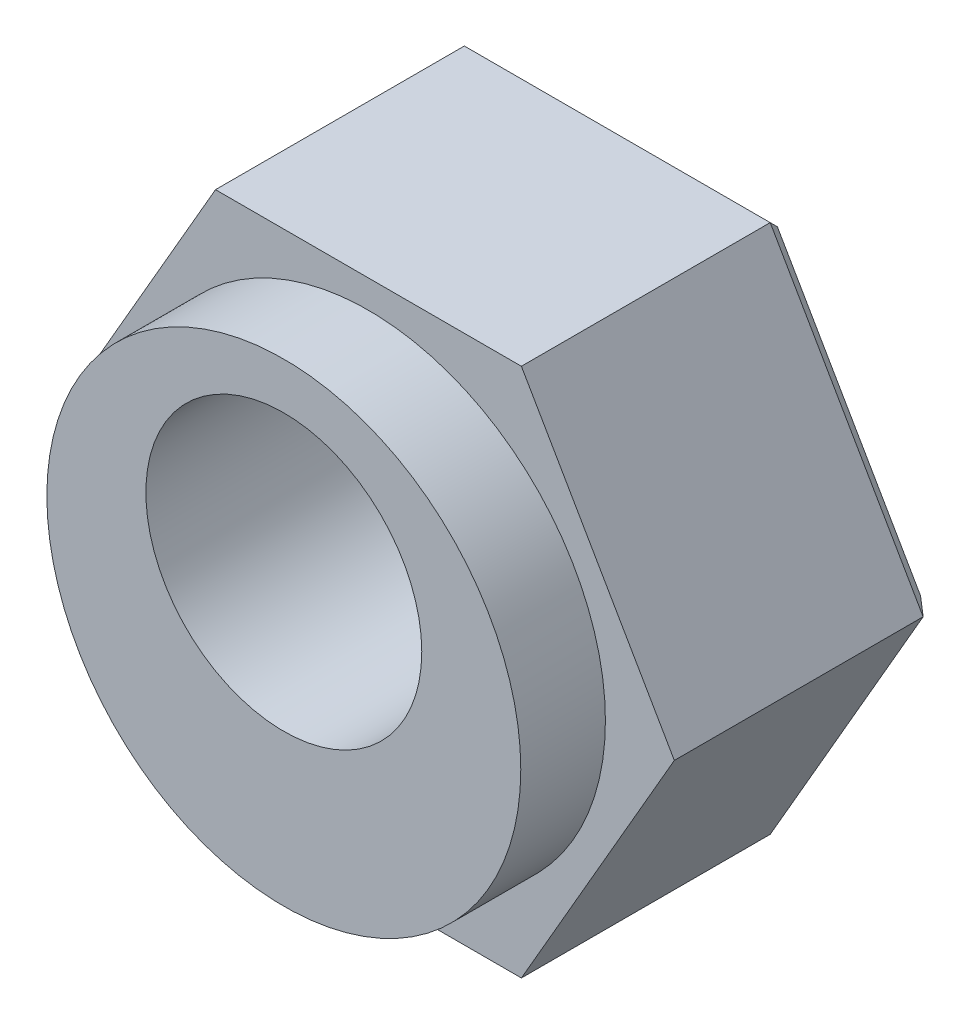
ISO-10303-21;
HEADER;
FILE_DESCRIPTION(('STEP AP214'),'2;1');
FILE_NAME('part.step','',(''),(''),'','','');
FILE_SCHEMA(('AUTOMOTIVE_DESIGN { 1 0 10303 214 1 1 1 1 }'));
ENDSEC;
DATA;
#1=APPLICATION_CONTEXT('core data for automotive mechanical design processes');
#2=APPLICATION_PROTOCOL_DEFINITION('international standard','automotive_design',2000,#1);
#3=PRODUCT_CONTEXT('',#1,'mechanical');
#4=PRODUCT('Part','Part','',(#3));
#5=PRODUCT_RELATED_PRODUCT_CATEGORY('part','',(#4));
#6=PRODUCT_DEFINITION_FORMATION('','',#4);
#7=PRODUCT_DEFINITION_CONTEXT('part definition',#1,'design');
#8=PRODUCT_DEFINITION('design','',#6,#7);
#9=PRODUCT_DEFINITION_SHAPE('','',#8);
#10=(LENGTH_UNIT() NAMED_UNIT(*) SI_UNIT(.MILLI.,.METRE.));
#11=(NAMED_UNIT(*) PLANE_ANGLE_UNIT() SI_UNIT($,.RADIAN.));
#12=(NAMED_UNIT(*) SI_UNIT($,.STERADIAN.) SOLID_ANGLE_UNIT());
#13=UNCERTAINTY_MEASURE_WITH_UNIT(LENGTH_MEASURE(1.E-05),#10,'distance_accuracy_value','');
#14=(GEOMETRIC_REPRESENTATION_CONTEXT(3) GLOBAL_UNCERTAINTY_ASSIGNED_CONTEXT((#13)) GLOBAL_UNIT_ASSIGNED_CONTEXT((#10,
#11,#12)) REPRESENTATION_CONTEXT('',''));
#15=CARTESIAN_POINT('',(0.,0.,0.));
#16=DIRECTION('',(0.,0.,1.));
#17=DIRECTION('',(1.,0.,0.));
#18=AXIS2_PLACEMENT_3D('',#15,#16,#17);
#19=CARTESIAN_POINT('',(-4.59005011011137,0.,0.));
#20=DIRECTION('',(-0.866025403784437,-0.500000000000003,0.));
#21=DIRECTION('',(0.500000000000003,-0.866025403784437,0.));
#22=AXIS2_PLACEMENT_3D('',#19,#20,#21);
#23=PLANE('',#22);
#24=DIRECTION('',(0.500000000000004,-0.866025403784436,0.));
#25=VECTOR('',#24,1.);
#26=CARTESIAN_POINT('',(-4.59005011011137,0.,3.9878));
#27=LINE('',#26,#25);
#28=CARTESIAN_POINT('',(-4.59005011011137,0.,3.9878));
#29=VERTEX_POINT('',#28);
#30=CARTESIAN_POINT('',(-2.29502505505567,-3.9751,3.9878));
#31=VERTEX_POINT('',#30);
#32=EDGE_CURVE('E105',#29,#31,#27,.T.);
#33=ORIENTED_EDGE('',*,*,#32,.F.);
#34=DIRECTION('',(0.,0.,1.));
#35=VECTOR('',#34,1.);
#36=CARTESIAN_POINT('',(-4.59005011011137,0.,0.));
#37=LINE('',#36,#35);
#38=CARTESIAN_POINT('',(-4.59005011011136,0.,0.254000000000001));
#39=VERTEX_POINT('',#38);
#40=EDGE_CURVE('E92',#39,#29,#37,.T.);
#41=ORIENTED_EDGE('',*,*,#40,.F.);
#42=DIRECTION('',(-0.500000000000004,0.866025403784436,0.));
#43=VECTOR('',#42,1.);
#44=CARTESIAN_POINT('',(-2.29502505505567,-3.9751,0.254000000000003));
#45=LINE('',#44,#43);
#46=CARTESIAN_POINT('',(-2.29502505505567,-3.9751,0.254));
#47=VERTEX_POINT('',#46);
#48=EDGE_CURVE('E172',#47,#39,#45,.T.);
#49=ORIENTED_EDGE('',*,*,#48,.F.);
#50=DIRECTION('',(0.,0.,1.));
#51=VECTOR('',#50,1.);
#52=CARTESIAN_POINT('',(-2.29502505505567,-3.9751,0.));
#53=LINE('',#52,#51);
#54=EDGE_CURVE('E109',#31,#47,#53,.F.);
#55=ORIENTED_EDGE('',*,*,#54,.F.);
#56=EDGE_LOOP('',(#33,#41,#49,#55));
#57=FACE_BOUND('',#56,.T.);
#58=ADVANCED_FACE('F16',(#57),#23,.T.);
#59=CARTESIAN_POINT('',(-2.29502505505567,-3.9751,0.));
#60=DIRECTION('',(0.,-1.,0.));
#61=DIRECTION('',(1.,0.,0.));
#62=AXIS2_PLACEMENT_3D('',#59,#60,#61);
#63=PLANE('',#62);
#64=DIRECTION('',(1.,0.,0.));
#65=VECTOR('',#64,1.);
#66=CARTESIAN_POINT('',(0.,-3.9751,3.9878));
#67=LINE('',#66,#65);
#68=CARTESIAN_POINT('',(2.2950250550557,-3.9751,3.9878));
#69=VERTEX_POINT('',#68);
#70=EDGE_CURVE('E111',#31,#69,#67,.T.);
#71=ORIENTED_EDGE('',*,*,#70,.F.);
#72=ORIENTED_EDGE('',*,*,#54,.T.);
#73=DIRECTION('',(1.,0.,0.));
#74=VECTOR('',#73,1.);
#75=CARTESIAN_POINT('',(-1.14751252752783,-3.9751,0.254));
#76=LINE('',#75,#74);
#77=CARTESIAN_POINT('',(2.2950250550557,-3.9751,0.254));
#78=VERTEX_POINT('',#77);
#79=EDGE_CURVE('E169',#78,#47,#76,.F.);
#80=ORIENTED_EDGE('',*,*,#79,.F.);
#81=DIRECTION('',(0.,0.,1.));
#82=VECTOR('',#81,1.);
#83=CARTESIAN_POINT('',(2.2950250550557,-3.9751,0.));
#84=LINE('',#83,#82);
#85=EDGE_CURVE('E121',#69,#78,#84,.F.);
#86=ORIENTED_EDGE('',*,*,#85,.F.);
#87=EDGE_LOOP('',(#71,#72,#80,#86));
#88=FACE_BOUND('',#87,.T.);
#89=ADVANCED_FACE('F335',(#88),#63,.T.);
#90=CARTESIAN_POINT('',(2.2950250550557,-3.9751,0.));
#91=DIRECTION('',(0.86602540378444,-0.499999999999998,0.));
#92=DIRECTION('',(0.499999999999998,0.86602540378444,0.));
#93=AXIS2_PLACEMENT_3D('',#90,#91,#92);
#94=PLANE('',#93);
#95=DIRECTION('',(0.499999999999997,0.86602540378444,0.));
#96=VECTOR('',#95,1.);
#97=CARTESIAN_POINT('',(2.2950250550557,-3.9751,3.9878));
#98=LINE('',#97,#96);
#99=CARTESIAN_POINT('',(4.59005011011137,0.,3.9878));
#100=VERTEX_POINT('',#99);
#101=EDGE_CURVE('E113',#69,#100,#98,.T.);
#102=ORIENTED_EDGE('',*,*,#101,.F.);
#103=ORIENTED_EDGE('',*,*,#85,.T.);
#104=DIRECTION('',(-0.499999999999997,-0.86602540378444,0.));
#105=VECTOR('',#104,1.);
#106=CARTESIAN_POINT('',(4.59005011011137,0.,0.253999999999995));
#107=LINE('',#106,#105);
#108=CARTESIAN_POINT('',(4.59005011011137,0.,0.253999999999999));
#109=VERTEX_POINT('',#108);
#110=EDGE_CURVE('E164',#109,#78,#107,.T.);
#111=ORIENTED_EDGE('',*,*,#110,.F.);
#112=DIRECTION('',(0.,0.,1.));
#113=VECTOR('',#112,1.);
#114=CARTESIAN_POINT('',(4.59005011011137,0.,0.));
#115=LINE('',#114,#113);
#116=EDGE_CURVE('E119',#100,#109,#115,.F.);
#117=ORIENTED_EDGE('',*,*,#116,.F.);
#118=EDGE_LOOP('',(#102,#103,#111,#117));
#119=FACE_BOUND('',#118,.T.);
#120=ADVANCED_FACE('F183',(#119),#94,.T.);
#121=CARTESIAN_POINT('',(4.59005011011137,0.,0.));
#122=DIRECTION('',(0.866025403784436,0.500000000000004,0.));
#123=DIRECTION('',(-0.500000000000004,0.866025403784436,0.));
#124=AXIS2_PLACEMENT_3D('',#121,#122,#123);
#125=PLANE('',#124);
#126=DIRECTION('',(-0.500000000000004,0.866025403784436,0.));
#127=VECTOR('',#126,1.);
#128=CARTESIAN_POINT('',(4.59005011011137,0.,3.9878));
#129=LINE('',#128,#127);
#130=CARTESIAN_POINT('',(2.29502505505566,3.9751,3.9878));
#131=VERTEX_POINT('',#130);
#132=EDGE_CURVE('E175',#100,#131,#129,.T.);
#133=ORIENTED_EDGE('',*,*,#132,.F.);
#134=ORIENTED_EDGE('',*,*,#116,.T.);
#135=DIRECTION('',(0.500000000000004,-0.866025403784436,0.));
#136=VECTOR('',#135,1.);
#137=CARTESIAN_POINT('',(2.29502505505567,3.9751,0.253999999999994));
#138=LINE('',#137,#136);
#139=CARTESIAN_POINT('',(2.29502505505567,3.9751,0.253999999999999));
#140=VERTEX_POINT('',#139);
#141=EDGE_CURVE('E159',#140,#109,#138,.T.);
#142=ORIENTED_EDGE('',*,*,#141,.F.);
#143=DIRECTION('',(0.,0.,1.));
#144=VECTOR('',#143,1.);
#145=CARTESIAN_POINT('',(2.29502505505566,3.9751,0.));
#146=LINE('',#145,#144);
#147=EDGE_CURVE('E100',#131,#140,#146,.F.);
#148=ORIENTED_EDGE('',*,*,#147,.F.);
#149=EDGE_LOOP('',(#133,#134,#142,#148));
#150=FACE_BOUND('',#149,.T.);
#151=ADVANCED_FACE('F187',(#150),#125,.T.);
#152=CARTESIAN_POINT('',(2.29502505505566,3.9751,0.));
#153=DIRECTION('',(0.,1.,0.));
#154=DIRECTION('',(-1.,0.,0.));
#155=AXIS2_PLACEMENT_3D('',#152,#153,#154);
#156=PLANE('',#155);
#157=DIRECTION('',(1.,0.,0.));
#158=VECTOR('',#157,1.);
#159=CARTESIAN_POINT('',(0.,3.9751,3.9878));
#160=LINE('',#159,#158);
#161=CARTESIAN_POINT('',(-2.29502505505569,3.9751,3.9878));
#162=VERTEX_POINT('',#161);
#163=EDGE_CURVE('E107',#131,#162,#160,.F.);
#164=ORIENTED_EDGE('',*,*,#163,.F.);
#165=ORIENTED_EDGE('',*,*,#147,.T.);
#166=DIRECTION('',(1.,0.,0.));
#167=VECTOR('',#166,1.);
#168=CARTESIAN_POINT('',(1.14751252752783,3.9751,0.254));
#169=LINE('',#168,#167);
#170=CARTESIAN_POINT('',(-2.29502505505569,3.97509999999999,0.254));
#171=VERTEX_POINT('',#170);
#172=EDGE_CURVE('E154',#171,#140,#169,.T.);
#173=ORIENTED_EDGE('',*,*,#172,.F.);
#174=DIRECTION('',(0.,0.,1.));
#175=VECTOR('',#174,1.);
#176=CARTESIAN_POINT('',(-2.29502505505569,3.9751,0.));
#177=LINE('',#176,#175);
#178=EDGE_CURVE('E85',#162,#171,#177,.F.);
#179=ORIENTED_EDGE('',*,*,#178,.F.);
#180=EDGE_LOOP('',(#164,#165,#173,#179));
#181=FACE_BOUND('',#180,.T.);
#182=ADVANCED_FACE('F189',(#181),#156,.T.);
#183=CARTESIAN_POINT('',(-2.29502505505569,3.9751,0.));
#184=DIRECTION('',(-0.86602540378444,0.499999999999997,0.));
#185=DIRECTION('',(-0.499999999999997,-0.86602540378444,0.));
#186=AXIS2_PLACEMENT_3D('',#183,#184,#185);
#187=PLANE('',#186);
#188=DIRECTION('',(-0.499999999999997,-0.86602540378444,0.));
#189=VECTOR('',#188,1.);
#190=CARTESIAN_POINT('',(-2.29502505505569,3.9751,3.9878));
#191=LINE('',#190,#189);
#192=EDGE_CURVE('E95',#162,#29,#191,.T.);
#193=ORIENTED_EDGE('',*,*,#192,.F.);
#194=ORIENTED_EDGE('',*,*,#178,.T.);
#195=DIRECTION('',(0.499999999999997,0.86602540378444,0.));
#196=VECTOR('',#195,1.);
#197=CARTESIAN_POINT('',(-4.59005011011137,0.,0.253999999999997));
#198=LINE('',#197,#196);
#199=EDGE_CURVE('E96',#39,#171,#198,.T.);
#200=ORIENTED_EDGE('',*,*,#199,.F.);
#201=ORIENTED_EDGE('',*,*,#40,.T.);
#202=EDGE_LOOP('',(#193,#194,#200,#201));
#203=FACE_BOUND('',#202,.T.);
#204=ADVANCED_FACE('F94',(#203),#187,.T.);
#205=CARTESIAN_POINT('',(0.,0.,3.9878));
#206=DIRECTION('',(0.,0.,1.));
#207=DIRECTION('',(1.,0.,0.));
#208=AXIS2_PLACEMENT_3D('',#205,#206,#207);
#209=PLANE('',#208);
#210=ORIENTED_EDGE('',*,*,#132,.T.);
#211=ORIENTED_EDGE('',*,*,#163,.T.);
#212=ORIENTED_EDGE('',*,*,#192,.T.);
#213=ORIENTED_EDGE('',*,*,#32,.T.);
#214=ORIENTED_EDGE('',*,*,#70,.T.);
#215=ORIENTED_EDGE('',*,*,#101,.T.);
#216=EDGE_LOOP('',(#210,#211,#212,#213,#214,#215));
#217=FACE_BOUND('',#216,.T.);
#218=CARTESIAN_POINT('',(0.,0.,3.9878));
#219=DIRECTION('',(0.,0.,1.));
#220=DIRECTION('',(1.,0.,0.));
#221=AXIS2_PLACEMENT_3D('',#218,#219,#220);
#222=CIRCLE('',#221,3.556);
#223=CARTESIAN_POINT('',(3.556,0.,3.9878));
#224=VERTEX_POINT('',#223);
#225=EDGE_CURVE('E19',#224,#224,#222,.T.);
#226=ORIENTED_EDGE('',*,*,#225,.F.);
#227=EDGE_LOOP('',(#226));
#228=FACE_BOUND('',#227,.T.);
#229=ADVANCED_FACE('F103',(#217,#228),#209,.T.);
#230=CARTESIAN_POINT('',(-3.9063086200668,-0.930275000000015,0.127));
#231=DIRECTION('',(-0.612372435695793,-0.353553390593276,-0.707106781186548));
#232=DIRECTION('',(-0.755928946018455,0.,0.654653670707976));
#233=AXIS2_PLACEMENT_3D('',#230,#231,#232);
#234=PLANE('',#233);
#235=ORIENTED_EDGE('',*,*,#48,.T.);
#236=DIRECTION('',(-0.755928946018454,0.,0.654653670707977));
#237=VECTOR('',#236,1.);
#238=CARTESIAN_POINT('',(-3.48077054219537,0.,-0.706664285714282));
#239=LINE('',#238,#237);
#240=CARTESIAN_POINT('',(-4.29675617336303,0.,0.));
#241=VERTEX_POINT('',#240);
#242=EDGE_CURVE('E150',#241,#39,#239,.T.);
#243=ORIENTED_EDGE('',*,*,#242,.F.);
#244=DIRECTION('',(0.500000000000003,-0.866025403784437,0.));
#245=VECTOR('',#244,1.);
#246=CARTESIAN_POINT('',(-4.29675617336302,0.,0.));
#247=LINE('',#246,#245);
#248=CARTESIAN_POINT('',(-2.1483780866815,-3.7211,0.));
#249=VERTEX_POINT('',#248);
#250=EDGE_CURVE('E145',#241,#249,#247,.T.);
#251=ORIENTED_EDGE('',*,*,#250,.T.);
#252=DIRECTION('',(0.37796447300923,0.654653670707976,-0.654653670707976));
#253=VECTOR('',#252,1.);
#254=CARTESIAN_POINT('',(-2.29502505505567,-3.9751,0.254));
#255=LINE('',#254,#253);
#256=EDGE_CURVE('E167',#47,#249,#255,.T.);
#257=ORIENTED_EDGE('',*,*,#256,.F.);
#258=EDGE_LOOP('',(#235,#243,#251,#257));
#259=FACE_BOUND('',#258,.T.);
#260=ADVANCED_FACE('F237',(#259),#234,.T.);
#261=CARTESIAN_POINT('',(-1.14751252752783,-3.8481,0.127));
#262=DIRECTION('',(0.,-0.707106781186548,-0.707106781186547));
#263=DIRECTION('',(0.,0.707106781186547,-0.707106781186548));
#264=AXIS2_PLACEMENT_3D('',#261,#262,#263);
#265=PLANE('',#264);
#266=ORIENTED_EDGE('',*,*,#79,.T.);
#267=ORIENTED_EDGE('',*,*,#256,.T.);
#268=DIRECTION('',(1.,0.,0.));
#269=VECTOR('',#268,1.);
#270=CARTESIAN_POINT('',(0.,-3.7211,0.));
#271=LINE('',#270,#269);
#272=CARTESIAN_POINT('',(2.14837808668153,-3.7211,0.));
#273=VERTEX_POINT('',#272);
#274=EDGE_CURVE('E142',#249,#273,#271,.T.);
#275=ORIENTED_EDGE('',*,*,#274,.T.);
#276=DIRECTION('',(-0.377964473009231,0.654653670707975,-0.654653670707978));
#277=VECTOR('',#276,1.);
#278=CARTESIAN_POINT('',(2.2950250550557,-3.9751,0.253999999999998));
#279=LINE('',#278,#277);
#280=EDGE_CURVE('E162',#78,#273,#279,.T.);
#281=ORIENTED_EDGE('',*,*,#280,.F.);
#282=EDGE_LOOP('',(#266,#267,#275,#281));
#283=FACE_BOUND('',#282,.T.);
#284=ADVANCED_FACE('F233',(#283),#265,.T.);
#285=CARTESIAN_POINT('',(2.75879609253899,-2.917825,0.127));
#286=DIRECTION('',(0.612372435695795,-0.353553390593272,-0.707106781186548));
#287=DIRECTION('',(-0.755928946018454,0.,-0.654653670707977));
#288=AXIS2_PLACEMENT_3D('',#285,#286,#287);
#289=PLANE('',#288);
#290=ORIENTED_EDGE('',*,*,#110,.T.);
#291=ORIENTED_EDGE('',*,*,#280,.T.);
#292=DIRECTION('',(0.5,0.866025403784439,0.));
#293=VECTOR('',#292,1.);
#294=CARTESIAN_POINT('',(2.14837808668153,-3.7211,0.));
#295=LINE('',#294,#293);
#296=CARTESIAN_POINT('',(4.29675617336305,0.,0.));
#297=VERTEX_POINT('',#296);
#298=EDGE_CURVE('E139',#273,#297,#295,.T.);
#299=ORIENTED_EDGE('',*,*,#298,.T.);
#300=DIRECTION('',(-0.755928946018455,0.,-0.654653670707977));
#301=VECTOR('',#300,1.);
#302=CARTESIAN_POINT('',(4.13649198649699,0.,-0.13879285714286));
#303=LINE('',#302,#301);
#304=EDGE_CURVE('E157',#109,#297,#303,.T.);
#305=ORIENTED_EDGE('',*,*,#304,.F.);
#306=EDGE_LOOP('',(#290,#291,#299,#305));
#307=FACE_BOUND('',#306,.T.);
#308=ADVANCED_FACE('F229',(#307),#289,.T.);
#309=CARTESIAN_POINT('',(3.90630862006683,0.930275000000013,0.127));
#310=DIRECTION('',(0.612372435695793,0.353553390593277,-0.707106781186547));
#311=DIRECTION('',(-0.755928946018455,0.,-0.654653670707977));
#312=AXIS2_PLACEMENT_3D('',#309,#310,#311);
#313=PLANE('',#312);
#314=DIRECTION('',(-0.500000000000006,0.866025403784435,0.));
#315=VECTOR('',#314,1.);
#316=CARTESIAN_POINT('',(4.29675617336305,0.,0.));
#317=LINE('',#316,#315);
#318=CARTESIAN_POINT('',(2.1483780866815,3.7211,0.));
#319=VERTEX_POINT('',#318);
#320=EDGE_CURVE('E134',#297,#319,#317,.T.);
#321=ORIENTED_EDGE('',*,*,#320,.T.);
#322=DIRECTION('',(-0.377964473009224,-0.654653670707978,-0.654653670707978));
#323=VECTOR('',#322,1.);
#324=CARTESIAN_POINT('',(2.29502505505566,3.9751,0.253999999999998));
#325=LINE('',#324,#323);
#326=EDGE_CURVE('E152',#140,#319,#325,.T.);
#327=ORIENTED_EDGE('',*,*,#326,.F.);
#328=ORIENTED_EDGE('',*,*,#141,.T.);
#329=ORIENTED_EDGE('',*,*,#304,.T.);
#330=EDGE_LOOP('',(#321,#327,#328,#329));
#331=FACE_BOUND('',#330,.T.);
#332=ADVANCED_FACE('F225',(#331),#313,.T.);
#333=CARTESIAN_POINT('',(1.14751252752783,3.8481,0.127));
#334=DIRECTION('',(0.,0.707106781186548,-0.707106781186547));
#335=DIRECTION('',(0.,0.707106781186547,0.707106781186548));
#336=AXIS2_PLACEMENT_3D('',#333,#334,#335);
#337=PLANE('',#336);
#338=DIRECTION('',(1.,0.,0.));
#339=VECTOR('',#338,1.);
#340=CARTESIAN_POINT('',(0.,3.7211,0.));
#341=LINE('',#340,#339);
#342=CARTESIAN_POINT('',(-2.14837808668153,3.7211,0.));
#343=VERTEX_POINT('',#342);
#344=EDGE_CURVE('E130',#319,#343,#341,.F.);
#345=ORIENTED_EDGE('',*,*,#344,.T.);
#346=DIRECTION('',(0.377964473009229,-0.654653670707977,-0.654653670707976));
#347=VECTOR('',#346,1.);
#348=CARTESIAN_POINT('',(-2.2950250550557,3.9751,0.253999999999996));
#349=LINE('',#348,#347);
#350=EDGE_CURVE('E34',#171,#343,#349,.T.);
#351=ORIENTED_EDGE('',*,*,#350,.F.);
#352=ORIENTED_EDGE('',*,*,#172,.T.);
#353=ORIENTED_EDGE('',*,*,#326,.T.);
#354=EDGE_LOOP('',(#345,#351,#352,#353));
#355=FACE_BOUND('',#354,.T.);
#356=ADVANCED_FACE('F222',(#355),#337,.T.);
#357=CARTESIAN_POINT('',(-2.75879609253899,2.917825,0.127));
#358=DIRECTION('',(-0.612372435695795,0.353553390593271,-0.707106781186548));
#359=DIRECTION('',(-0.755928946018454,0.,0.654653670707977));
#360=AXIS2_PLACEMENT_3D('',#357,#358,#359);
#361=PLANE('',#360);
#362=ORIENTED_EDGE('',*,*,#199,.T.);
#363=ORIENTED_EDGE('',*,*,#350,.T.);
#364=DIRECTION('',(-0.499999999999995,-0.866025403784441,0.));
#365=VECTOR('',#364,1.);
#366=CARTESIAN_POINT('',(-2.14837808668153,3.7211,0.));
#367=LINE('',#366,#365);
#368=EDGE_CURVE('E127',#343,#241,#367,.T.);
#369=ORIENTED_EDGE('',*,*,#368,.T.);
#370=ORIENTED_EDGE('',*,*,#242,.T.);
#371=EDGE_LOOP('',(#362,#363,#369,#370));
#372=FACE_BOUND('',#371,.T.);
#373=ADVANCED_FACE('F218',(#372),#361,.T.);
#374=CARTESIAN_POINT('',(0.,0.,3.9878));
#375=DIRECTION('',(0.,0.,1.));
#376=DIRECTION('',(1.,0.,0.));
#377=AXIS2_PLACEMENT_3D('',#374,#375,#376);
#378=CYLINDRICAL_SURFACE('',#377,3.556);
#379=ORIENTED_EDGE('',*,*,#225,.T.);
#380=EDGE_LOOP('',(#379));
#381=FACE_BOUND('',#380,.T.);
#382=CARTESIAN_POINT('',(0.,0.,5.2578));
#383=DIRECTION('',(0.,0.,1.));
#384=DIRECTION('',(1.,0.,0.));
#385=AXIS2_PLACEMENT_3D('',#382,#383,#384);
#386=CIRCLE('',#385,3.556);
#387=CARTESIAN_POINT('',(3.556,0.,5.2578));
#388=VERTEX_POINT('',#387);
#389=EDGE_CURVE('E125',#388,#388,#386,.T.);
#390=ORIENTED_EDGE('',*,*,#389,.F.);
#391=EDGE_LOOP('',(#390));
#392=FACE_BOUND('',#391,.T.);
#393=ADVANCED_FACE('F214',(#381,#392),#378,.T.);
#394=CARTESIAN_POINT('',(0.,0.,0.));
#395=DIRECTION('',(0.,0.,1.));
#396=DIRECTION('',(1.,0.,0.));
#397=AXIS2_PLACEMENT_3D('',#394,#395,#396);
#398=PLANE('',#397);
#399=ORIENTED_EDGE('',*,*,#344,.F.);
#400=ORIENTED_EDGE('',*,*,#320,.F.);
#401=ORIENTED_EDGE('',*,*,#298,.F.);
#402=ORIENTED_EDGE('',*,*,#274,.F.);
#403=ORIENTED_EDGE('',*,*,#250,.F.);
#404=ORIENTED_EDGE('',*,*,#368,.F.);
#405=EDGE_LOOP('',(#399,#400,#401,#402,#403,#404));
#406=FACE_BOUND('',#405,.T.);
#407=CARTESIAN_POINT('',(0.,0.7874,0.));
#408=DIRECTION('',(0.,0.,1.));
#409=DIRECTION('',(1.,0.,0.));
#410=AXIS2_PLACEMENT_3D('',#407,#408,#409);
#411=CIRCLE('',#410,2.0701);
#412=CARTESIAN_POINT('',(2.0701,0.7874,0.));
#413=VERTEX_POINT('',#412);
#414=EDGE_CURVE('E25',#413,#413,#411,.T.);
#415=ORIENTED_EDGE('',*,*,#414,.T.);
#416=EDGE_LOOP('',(#415));
#417=FACE_BOUND('',#416,.T.);
#418=ADVANCED_FACE('F207',(#406,#417),#398,.F.);
#419=CARTESIAN_POINT('',(0.,0.,5.2578));
#420=DIRECTION('',(0.,0.,1.));
#421=DIRECTION('',(1.,0.,0.));
#422=AXIS2_PLACEMENT_3D('',#419,#420,#421);
#423=PLANE('',#422);
#424=ORIENTED_EDGE('',*,*,#389,.T.);
#425=EDGE_LOOP('',(#424));
#426=FACE_BOUND('',#425,.T.);
#427=CARTESIAN_POINT('',(0.,0.7874,5.2578));
#428=DIRECTION('',(0.,0.,1.));
#429=DIRECTION('',(1.,0.,0.));
#430=AXIS2_PLACEMENT_3D('',#427,#428,#429);
#431=CIRCLE('',#430,2.0701);
#432=CARTESIAN_POINT('',(2.0701,0.7874,5.2578));
#433=VERTEX_POINT('',#432);
#434=EDGE_CURVE('E11',#433,#433,#431,.F.);
#435=ORIENTED_EDGE('',*,*,#434,.T.);
#436=EDGE_LOOP('',(#435));
#437=FACE_BOUND('',#436,.T.);
#438=ADVANCED_FACE('F201',(#426,#437),#423,.T.);
#439=CARTESIAN_POINT('',(0.,0.7874,-7.97565687767687));
#440=DIRECTION('',(0.,0.,1.));
#441=DIRECTION('',(1.,0.,0.));
#442=AXIS2_PLACEMENT_3D('',#439,#440,#441);
#443=CYLINDRICAL_SURFACE('',#442,2.0701);
#444=ORIENTED_EDGE('',*,*,#434,.F.);
#445=EDGE_LOOP('',(#444));
#446=FACE_BOUND('',#445,.T.);
#447=ORIENTED_EDGE('',*,*,#414,.F.);
#448=EDGE_LOOP('',(#447));
#449=FACE_BOUND('',#448,.T.);
#450=ADVANCED_FACE('F199',(#446,#449),#443,.F.);
#451=CLOSED_SHELL('',(#58,#89,#120,#151,#182,#204,#229,#260,#284,#308,#332,#356,#373,#393,#418,
#438,#450));
#452=MANIFOLD_SOLID_BREP('B1',#451);
#453=ADVANCED_BREP_SHAPE_REPRESENTATION('',(#18,#452),#14);
#454=SHAPE_DEFINITION_REPRESENTATION(#9,#453);
ENDSEC;
END-ISO-10303-21;
